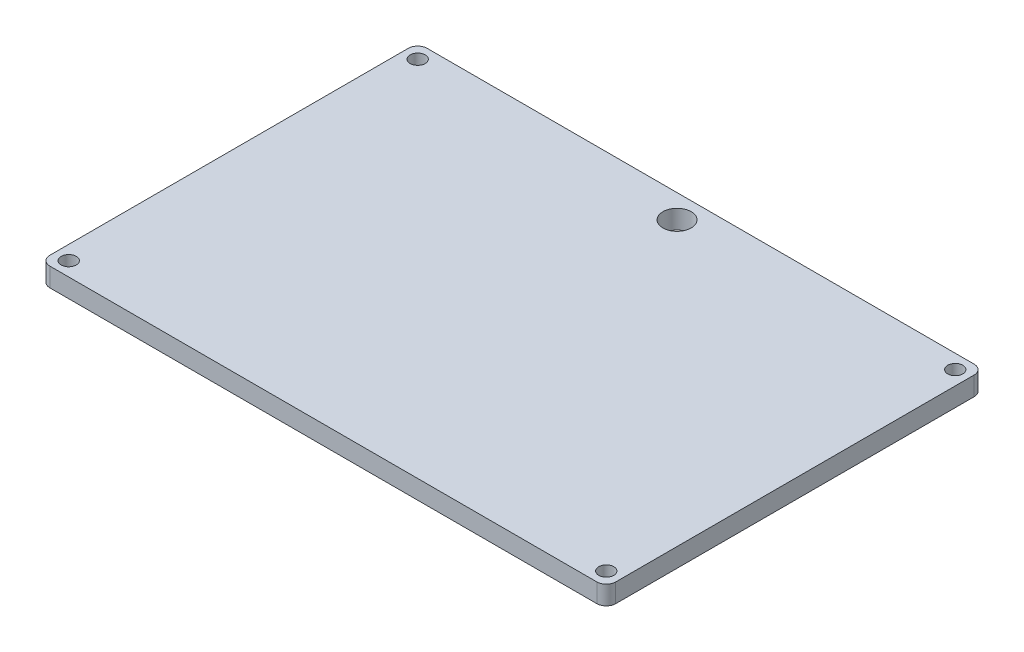
ISO-10303-21;
HEADER;
FILE_DESCRIPTION(('STEP AP214'),'2;1');
FILE_NAME('part.step','',(''),(''),'','','');
FILE_SCHEMA(('AUTOMOTIVE_DESIGN { 1 0 10303 214 1 1 1 1 }'));
ENDSEC;
DATA;
#1=APPLICATION_CONTEXT('core data for automotive mechanical design processes');
#2=APPLICATION_PROTOCOL_DEFINITION('international standard','automotive_design',2000,#1);
#3=PRODUCT_CONTEXT('',#1,'mechanical');
#4=PRODUCT('Part','Part','',(#3));
#5=PRODUCT_RELATED_PRODUCT_CATEGORY('part','',(#4));
#6=PRODUCT_DEFINITION_FORMATION('','',#4);
#7=PRODUCT_DEFINITION_CONTEXT('part definition',#1,'design');
#8=PRODUCT_DEFINITION('design','',#6,#7);
#9=PRODUCT_DEFINITION_SHAPE('','',#8);
#10=(LENGTH_UNIT() NAMED_UNIT(*) SI_UNIT(.MILLI.,.METRE.));
#11=(NAMED_UNIT(*) PLANE_ANGLE_UNIT() SI_UNIT($,.RADIAN.));
#12=(NAMED_UNIT(*) SI_UNIT($,.STERADIAN.) SOLID_ANGLE_UNIT());
#13=UNCERTAINTY_MEASURE_WITH_UNIT(LENGTH_MEASURE(1.E-05),#10,'distance_accuracy_value','');
#14=(GEOMETRIC_REPRESENTATION_CONTEXT(3) GLOBAL_UNCERTAINTY_ASSIGNED_CONTEXT((#13)) GLOBAL_UNIT_ASSIGNED_CONTEXT((#10,
#11,#12)) REPRESENTATION_CONTEXT('',''));
#15=CARTESIAN_POINT('',(0.,0.,0.));
#16=DIRECTION('',(0.,0.,1.));
#17=DIRECTION('',(1.,0.,0.));
#18=AXIS2_PLACEMENT_3D('',#15,#16,#17);
#19=CARTESIAN_POINT('',(0.,4.,0.));
#20=DIRECTION('',(0.,-1.,0.));
#21=DIRECTION('',(0.,0.,-1.));
#22=AXIS2_PLACEMENT_3D('',#19,#20,#21);
#23=PLANE('',#22);
#24=DIRECTION('',(-1.,0.,0.));
#25=VECTOR('',#24,1.);
#26=CARTESIAN_POINT('',(0.,4.,-80.));
#27=LINE('',#26,#25);
#28=CARTESIAN_POINT('',(118.,4.,-80.));
#29=VERTEX_POINT('',#28);
#30=CARTESIAN_POINT('',(2.,4.,-80.));
#31=VERTEX_POINT('',#30);
#32=EDGE_CURVE('E125',#29,#31,#27,.T.);
#33=ORIENTED_EDGE('',*,*,#32,.T.);
#34=CARTESIAN_POINT('',(2.,4.,-78.));
#35=DIRECTION('',(0.,-1.,0.));
#36=DIRECTION('',(0.,0.,-1.));
#37=AXIS2_PLACEMENT_3D('',#34,#35,#36);
#38=CIRCLE('',#37,2.);
#39=CARTESIAN_POINT('',(0.,4.,-78.));
#40=VERTEX_POINT('',#39);
#41=EDGE_CURVE('E11',#31,#40,#38,.F.);
#42=ORIENTED_EDGE('',*,*,#41,.T.);
#43=DIRECTION('',(0.,0.,1.));
#44=VECTOR('',#43,1.);
#45=CARTESIAN_POINT('',(0.,4.,0.));
#46=LINE('',#45,#44);
#47=CARTESIAN_POINT('',(0.,4.,-2.));
#48=VERTEX_POINT('',#47);
#49=EDGE_CURVE('E145',#40,#48,#46,.T.);
#50=ORIENTED_EDGE('',*,*,#49,.T.);
#51=CARTESIAN_POINT('',(2.,4.,-2.));
#52=DIRECTION('',(0.,-1.,0.));
#53=DIRECTION('',(0.,0.,-1.));
#54=AXIS2_PLACEMENT_3D('',#51,#52,#53);
#55=CIRCLE('',#54,2.);
#56=CARTESIAN_POINT('',(2.,4.,0.));
#57=VERTEX_POINT('',#56);
#58=EDGE_CURVE('E149',#48,#57,#55,.F.);
#59=ORIENTED_EDGE('',*,*,#58,.T.);
#60=DIRECTION('',(1.,0.,0.));
#61=VECTOR('',#60,1.);
#62=CARTESIAN_POINT('',(0.,4.,0.));
#63=LINE('',#62,#61);
#64=CARTESIAN_POINT('',(118.,4.,0.));
#65=VERTEX_POINT('',#64);
#66=EDGE_CURVE('E123',#57,#65,#63,.T.);
#67=ORIENTED_EDGE('',*,*,#66,.T.);
#68=CARTESIAN_POINT('',(118.,4.,-2.));
#69=DIRECTION('',(0.,-1.,0.));
#70=DIRECTION('',(0.,0.,-1.));
#71=AXIS2_PLACEMENT_3D('',#68,#69,#70);
#72=CIRCLE('',#71,2.);
#73=CARTESIAN_POINT('',(120.,4.,-2.));
#74=VERTEX_POINT('',#73);
#75=EDGE_CURVE('E161',#65,#74,#72,.F.);
#76=ORIENTED_EDGE('',*,*,#75,.T.);
#77=DIRECTION('',(0.,0.,-1.));
#78=VECTOR('',#77,1.);
#79=CARTESIAN_POINT('',(120.,4.,0.));
#80=LINE('',#79,#78);
#81=CARTESIAN_POINT('',(120.,4.,-78.));
#82=VERTEX_POINT('',#81);
#83=EDGE_CURVE('E185',#74,#82,#80,.T.);
#84=ORIENTED_EDGE('',*,*,#83,.T.);
#85=CARTESIAN_POINT('',(118.,4.,-78.));
#86=DIRECTION('',(0.,-1.,0.));
#87=DIRECTION('',(0.,0.,-1.));
#88=AXIS2_PLACEMENT_3D('',#85,#86,#87);
#89=CIRCLE('',#88,2.);
#90=EDGE_CURVE('E174',#82,#29,#89,.F.);
#91=ORIENTED_EDGE('',*,*,#90,.T.);
#92=EDGE_LOOP('',(#33,#42,#50,#59,#67,#76,#84,#91));
#93=FACE_BOUND('',#92,.T.);
#94=CARTESIAN_POINT('',(3.,4.,-77.));
#95=DIRECTION('',(0.,1.,0.));
#96=DIRECTION('',(0.,0.,1.));
#97=AXIS2_PLACEMENT_3D('',#94,#95,#96);
#98=CIRCLE('',#97,1.6);
#99=CARTESIAN_POINT('',(3.,4.,-75.4));
#100=VERTEX_POINT('',#99);
#101=EDGE_CURVE('E140',#100,#100,#98,.T.);
#102=ORIENTED_EDGE('',*,*,#101,.F.);
#103=EDGE_LOOP('',(#102));
#104=FACE_BOUND('',#103,.T.);
#105=CARTESIAN_POINT('',(3.,4.,-3.));
#106=DIRECTION('',(0.,1.,0.));
#107=DIRECTION('',(0.,0.,1.));
#108=AXIS2_PLACEMENT_3D('',#105,#106,#107);
#109=CIRCLE('',#108,1.6);
#110=CARTESIAN_POINT('',(3.,4.,-1.4));
#111=VERTEX_POINT('',#110);
#112=EDGE_CURVE('E199',#111,#111,#109,.T.);
#113=ORIENTED_EDGE('',*,*,#112,.F.);
#114=EDGE_LOOP('',(#113));
#115=FACE_BOUND('',#114,.T.);
#116=CARTESIAN_POINT('',(117.,4.,-77.));
#117=DIRECTION('',(0.,1.,0.));
#118=DIRECTION('',(0.,0.,1.));
#119=AXIS2_PLACEMENT_3D('',#116,#117,#118);
#120=CIRCLE('',#119,1.60000000000001);
#121=CARTESIAN_POINT('',(117.,4.,-75.4));
#122=VERTEX_POINT('',#121);
#123=EDGE_CURVE('E207',#122,#122,#120,.T.);
#124=ORIENTED_EDGE('',*,*,#123,.F.);
#125=EDGE_LOOP('',(#124));
#126=FACE_BOUND('',#125,.T.);
#127=CARTESIAN_POINT('',(117.,4.,-3.));
#128=DIRECTION('',(0.,1.,0.));
#129=DIRECTION('',(0.,0.,1.));
#130=AXIS2_PLACEMENT_3D('',#127,#128,#129);
#131=CIRCLE('',#130,1.60000000000001);
#132=CARTESIAN_POINT('',(117.,4.,-1.4));
#133=VERTEX_POINT('',#132);
#134=EDGE_CURVE('E215',#133,#133,#131,.T.);
#135=ORIENTED_EDGE('',*,*,#134,.F.);
#136=EDGE_LOOP('',(#135));
#137=FACE_BOUND('',#136,.T.);
#138=CARTESIAN_POINT('',(60.,4.,-75.));
#139=DIRECTION('',(0.,1.,0.));
#140=DIRECTION('',(0.,0.,1.));
#141=AXIS2_PLACEMENT_3D('',#138,#139,#140);
#142=CIRCLE('',#141,3.00000000000001);
#143=CARTESIAN_POINT('',(60.,4.,-72.));
#144=VERTEX_POINT('',#143);
#145=EDGE_CURVE('E223',#144,#144,#142,.T.);
#146=ORIENTED_EDGE('',*,*,#145,.F.);
#147=EDGE_LOOP('',(#146));
#148=FACE_BOUND('',#147,.T.);
#149=ADVANCED_FACE('F39',(#93,#104,#115,#126,#137,#148),#23,.F.);
#150=CARTESIAN_POINT('',(0.,0.,0.));
#151=DIRECTION('',(0.,-1.,0.));
#152=DIRECTION('',(0.,0.,-1.));
#153=AXIS2_PLACEMENT_3D('',#150,#151,#152);
#154=PLANE('',#153);
#155=CARTESIAN_POINT('',(117.,0.,-3.));
#156=DIRECTION('',(0.,1.,0.));
#157=DIRECTION('',(0.,0.,1.));
#158=AXIS2_PLACEMENT_3D('',#155,#156,#157);
#159=CIRCLE('',#158,1.60000000000001);
#160=CARTESIAN_POINT('',(117.,0.,-1.4));
#161=VERTEX_POINT('',#160);
#162=EDGE_CURVE('E219',#161,#161,#159,.T.);
#163=ORIENTED_EDGE('',*,*,#162,.T.);
#164=EDGE_LOOP('',(#163));
#165=FACE_BOUND('',#164,.T.);
#166=CARTESIAN_POINT('',(3.,0.,-3.));
#167=DIRECTION('',(0.,1.,0.));
#168=DIRECTION('',(0.,0.,1.));
#169=AXIS2_PLACEMENT_3D('',#166,#167,#168);
#170=CIRCLE('',#169,1.6);
#171=CARTESIAN_POINT('',(3.,0.,-1.4));
#172=VERTEX_POINT('',#171);
#173=EDGE_CURVE('E203',#172,#172,#170,.T.);
#174=ORIENTED_EDGE('',*,*,#173,.T.);
#175=EDGE_LOOP('',(#174));
#176=FACE_BOUND('',#175,.T.);
#177=DIRECTION('',(0.,0.,1.));
#178=VECTOR('',#177,1.);
#179=CARTESIAN_POINT('',(0.,0.,0.));
#180=LINE('',#179,#178);
#181=CARTESIAN_POINT('',(0.,0.,-78.));
#182=VERTEX_POINT('',#181);
#183=CARTESIAN_POINT('',(0.,0.,-2.));
#184=VERTEX_POINT('',#183);
#185=EDGE_CURVE('E133',#182,#184,#180,.T.);
#186=ORIENTED_EDGE('',*,*,#185,.F.);
#187=CARTESIAN_POINT('',(2.,0.,-78.));
#188=DIRECTION('',(0.,-1.,0.));
#189=DIRECTION('',(0.,0.,-1.));
#190=AXIS2_PLACEMENT_3D('',#187,#188,#189);
#191=CIRCLE('',#190,2.);
#192=CARTESIAN_POINT('',(2.,0.,-80.));
#193=VERTEX_POINT('',#192);
#194=EDGE_CURVE('E62',#182,#193,#191,.T.);
#195=ORIENTED_EDGE('',*,*,#194,.T.);
#196=DIRECTION('',(-1.,0.,0.));
#197=VECTOR('',#196,1.);
#198=CARTESIAN_POINT('',(0.,0.,-80.));
#199=LINE('',#198,#197);
#200=CARTESIAN_POINT('',(118.,0.,-80.));
#201=VERTEX_POINT('',#200);
#202=EDGE_CURVE('E138',#201,#193,#199,.T.);
#203=ORIENTED_EDGE('',*,*,#202,.F.);
#204=CARTESIAN_POINT('',(118.,0.,-78.));
#205=DIRECTION('',(0.,-1.,0.));
#206=DIRECTION('',(0.,0.,-1.));
#207=AXIS2_PLACEMENT_3D('',#204,#205,#206);
#208=CIRCLE('',#207,2.);
#209=CARTESIAN_POINT('',(120.,0.,-78.));
#210=VERTEX_POINT('',#209);
#211=EDGE_CURVE('E168',#201,#210,#208,.T.);
#212=ORIENTED_EDGE('',*,*,#211,.T.);
#213=DIRECTION('',(0.,0.,-1.));
#214=VECTOR('',#213,1.);
#215=CARTESIAN_POINT('',(120.,0.,0.));
#216=LINE('',#215,#214);
#217=CARTESIAN_POINT('',(120.,0.,-2.));
#218=VERTEX_POINT('',#217);
#219=EDGE_CURVE('E132',#218,#210,#216,.T.);
#220=ORIENTED_EDGE('',*,*,#219,.F.);
#221=CARTESIAN_POINT('',(118.,0.,-2.));
#222=DIRECTION('',(0.,-1.,0.));
#223=DIRECTION('',(0.,0.,-1.));
#224=AXIS2_PLACEMENT_3D('',#221,#222,#223);
#225=CIRCLE('',#224,2.);
#226=CARTESIAN_POINT('',(118.,0.,0.));
#227=VERTEX_POINT('',#226);
#228=EDGE_CURVE('E130',#218,#227,#225,.T.);
#229=ORIENTED_EDGE('',*,*,#228,.T.);
#230=DIRECTION('',(1.,0.,0.));
#231=VECTOR('',#230,1.);
#232=CARTESIAN_POINT('',(0.,0.,0.));
#233=LINE('',#232,#231);
#234=CARTESIAN_POINT('',(2.,0.,0.));
#235=VERTEX_POINT('',#234);
#236=EDGE_CURVE('E120',#235,#227,#233,.T.);
#237=ORIENTED_EDGE('',*,*,#236,.F.);
#238=CARTESIAN_POINT('',(2.,0.,-2.));
#239=DIRECTION('',(0.,-1.,0.));
#240=DIRECTION('',(0.,0.,-1.));
#241=AXIS2_PLACEMENT_3D('',#238,#239,#240);
#242=CIRCLE('',#241,2.);
#243=EDGE_CURVE('E106',#235,#184,#242,.T.);
#244=ORIENTED_EDGE('',*,*,#243,.T.);
#245=EDGE_LOOP('',(#186,#195,#203,#212,#220,#229,#237,#244));
#246=FACE_BOUND('',#245,.T.);
#247=CARTESIAN_POINT('',(3.,0.,-77.));
#248=DIRECTION('',(0.,1.,0.));
#249=DIRECTION('',(0.,0.,1.));
#250=AXIS2_PLACEMENT_3D('',#247,#248,#249);
#251=CIRCLE('',#250,1.6);
#252=CARTESIAN_POINT('',(3.,0.,-75.4));
#253=VERTEX_POINT('',#252);
#254=EDGE_CURVE('E195',#253,#253,#251,.T.);
#255=ORIENTED_EDGE('',*,*,#254,.T.);
#256=EDGE_LOOP('',(#255));
#257=FACE_BOUND('',#256,.T.);
#258=CARTESIAN_POINT('',(117.,0.,-77.));
#259=DIRECTION('',(0.,1.,0.));
#260=DIRECTION('',(0.,0.,1.));
#261=AXIS2_PLACEMENT_3D('',#258,#259,#260);
#262=CIRCLE('',#261,1.60000000000001);
#263=CARTESIAN_POINT('',(117.,0.,-75.4));
#264=VERTEX_POINT('',#263);
#265=EDGE_CURVE('E211',#264,#264,#262,.T.);
#266=ORIENTED_EDGE('',*,*,#265,.T.);
#267=EDGE_LOOP('',(#266));
#268=FACE_BOUND('',#267,.T.);
#269=CARTESIAN_POINT('',(60.,0.,-75.));
#270=DIRECTION('',(0.,1.,0.));
#271=DIRECTION('',(0.,0.,1.));
#272=AXIS2_PLACEMENT_3D('',#269,#270,#271);
#273=CIRCLE('',#272,3.00000000000001);
#274=CARTESIAN_POINT('',(60.,0.,-72.));
#275=VERTEX_POINT('',#274);
#276=EDGE_CURVE('E227',#275,#275,#273,.T.);
#277=ORIENTED_EDGE('',*,*,#276,.T.);
#278=EDGE_LOOP('',(#277));
#279=FACE_BOUND('',#278,.T.);
#280=ADVANCED_FACE('F127',(#165,#176,#246,#257,#268,#279),#154,.T.);
#281=CARTESIAN_POINT('',(0.,4.,0.));
#282=DIRECTION('',(1.,0.,0.));
#283=DIRECTION('',(0.,0.,-1.));
#284=AXIS2_PLACEMENT_3D('',#281,#282,#283);
#285=PLANE('',#284);
#286=ORIENTED_EDGE('',*,*,#49,.F.);
#287=DIRECTION('',(0.,-1.,0.));
#288=VECTOR('',#287,1.);
#289=CARTESIAN_POINT('',(0.,4.,-78.));
#290=LINE('',#289,#288);
#291=EDGE_CURVE('E177',#40,#182,#290,.T.);
#292=ORIENTED_EDGE('',*,*,#291,.T.);
#293=ORIENTED_EDGE('',*,*,#185,.T.);
#294=DIRECTION('',(0.,-1.,0.));
#295=VECTOR('',#294,1.);
#296=CARTESIAN_POINT('',(0.,4.,-2.));
#297=LINE('',#296,#295);
#298=EDGE_CURVE('E112',#184,#48,#297,.F.);
#299=ORIENTED_EDGE('',*,*,#298,.T.);
#300=EDGE_LOOP('',(#286,#292,#293,#299));
#301=FACE_BOUND('',#300,.T.);
#302=ADVANCED_FACE('F243',(#301),#285,.F.);
#303=CARTESIAN_POINT('',(0.,4.,0.));
#304=DIRECTION('',(0.,0.,-1.));
#305=DIRECTION('',(-1.,0.,0.));
#306=AXIS2_PLACEMENT_3D('',#303,#304,#305);
#307=PLANE('',#306);
#308=ORIENTED_EDGE('',*,*,#236,.T.);
#309=DIRECTION('',(0.,-1.,0.));
#310=VECTOR('',#309,1.);
#311=CARTESIAN_POINT('',(118.,4.,0.));
#312=LINE('',#311,#310);
#313=EDGE_CURVE('E158',#227,#65,#312,.F.);
#314=ORIENTED_EDGE('',*,*,#313,.T.);
#315=ORIENTED_EDGE('',*,*,#66,.F.);
#316=DIRECTION('',(0.,-1.,0.));
#317=VECTOR('',#316,1.);
#318=CARTESIAN_POINT('',(2.,4.,0.));
#319=LINE('',#318,#317);
#320=EDGE_CURVE('E110',#57,#235,#319,.T.);
#321=ORIENTED_EDGE('',*,*,#320,.T.);
#322=EDGE_LOOP('',(#308,#314,#315,#321));
#323=FACE_BOUND('',#322,.T.);
#324=ADVANCED_FACE('F119',(#323),#307,.F.);
#325=CARTESIAN_POINT('',(120.,4.,0.));
#326=DIRECTION('',(-1.,0.,0.));
#327=DIRECTION('',(0.,0.,1.));
#328=AXIS2_PLACEMENT_3D('',#325,#326,#327);
#329=PLANE('',#328);
#330=ORIENTED_EDGE('',*,*,#219,.T.);
#331=DIRECTION('',(0.,-1.,0.));
#332=VECTOR('',#331,1.);
#333=CARTESIAN_POINT('',(120.,4.,-78.));
#334=LINE('',#333,#332);
#335=EDGE_CURVE('E171',#210,#82,#334,.F.);
#336=ORIENTED_EDGE('',*,*,#335,.T.);
#337=ORIENTED_EDGE('',*,*,#83,.F.);
#338=DIRECTION('',(0.,-1.,0.));
#339=VECTOR('',#338,1.);
#340=CARTESIAN_POINT('',(120.,4.,-2.));
#341=LINE('',#340,#339);
#342=EDGE_CURVE('E152',#74,#218,#341,.T.);
#343=ORIENTED_EDGE('',*,*,#342,.T.);
#344=EDGE_LOOP('',(#330,#336,#337,#343));
#345=FACE_BOUND('',#344,.T.);
#346=ADVANCED_FACE('F254',(#345),#329,.F.);
#347=CARTESIAN_POINT('',(0.,4.,-80.));
#348=DIRECTION('',(0.,0.,1.));
#349=DIRECTION('',(1.,0.,0.));
#350=AXIS2_PLACEMENT_3D('',#347,#348,#349);
#351=PLANE('',#350);
#352=ORIENTED_EDGE('',*,*,#202,.T.);
#353=DIRECTION('',(0.,-1.,0.));
#354=VECTOR('',#353,1.);
#355=CARTESIAN_POINT('',(2.,4.,-80.));
#356=LINE('',#355,#354);
#357=EDGE_CURVE('E48',#193,#31,#356,.F.);
#358=ORIENTED_EDGE('',*,*,#357,.T.);
#359=ORIENTED_EDGE('',*,*,#32,.F.);
#360=DIRECTION('',(0.,-1.,0.));
#361=VECTOR('',#360,1.);
#362=CARTESIAN_POINT('',(118.,4.,-80.));
#363=LINE('',#362,#361);
#364=EDGE_CURVE('E164',#29,#201,#363,.T.);
#365=ORIENTED_EDGE('',*,*,#364,.T.);
#366=EDGE_LOOP('',(#352,#358,#359,#365));
#367=FACE_BOUND('',#366,.T.);
#368=ADVANCED_FACE('F251',(#367),#351,.F.);
#369=CARTESIAN_POINT('',(3.,4.,-77.));
#370=DIRECTION('',(0.,-1.,0.));
#371=DIRECTION('',(0.,0.,-1.));
#372=AXIS2_PLACEMENT_3D('',#369,#370,#371);
#373=CYLINDRICAL_SURFACE('',#372,1.6);
#374=ORIENTED_EDGE('',*,*,#101,.T.);
#375=EDGE_LOOP('',(#374));
#376=FACE_BOUND('',#375,.T.);
#377=ORIENTED_EDGE('',*,*,#254,.F.);
#378=EDGE_LOOP('',(#377));
#379=FACE_BOUND('',#378,.T.);
#380=ADVANCED_FACE('F248',(#376,#379),#373,.F.);
#381=CARTESIAN_POINT('',(3.,4.,-3.));
#382=DIRECTION('',(0.,-1.,0.));
#383=DIRECTION('',(0.,0.,-1.));
#384=AXIS2_PLACEMENT_3D('',#381,#382,#383);
#385=CYLINDRICAL_SURFACE('',#384,1.6);
#386=ORIENTED_EDGE('',*,*,#112,.T.);
#387=EDGE_LOOP('',(#386));
#388=FACE_BOUND('',#387,.T.);
#389=ORIENTED_EDGE('',*,*,#173,.F.);
#390=EDGE_LOOP('',(#389));
#391=FACE_BOUND('',#390,.T.);
#392=ADVANCED_FACE('F365',(#388,#391),#385,.F.);
#393=CARTESIAN_POINT('',(117.,4.,-77.));
#394=DIRECTION('',(0.,-1.,0.));
#395=DIRECTION('',(0.,0.,-1.));
#396=AXIS2_PLACEMENT_3D('',#393,#394,#395);
#397=CYLINDRICAL_SURFACE('',#396,1.60000000000001);
#398=ORIENTED_EDGE('',*,*,#123,.T.);
#399=EDGE_LOOP('',(#398));
#400=FACE_BOUND('',#399,.T.);
#401=ORIENTED_EDGE('',*,*,#265,.F.);
#402=EDGE_LOOP('',(#401));
#403=FACE_BOUND('',#402,.T.);
#404=ADVANCED_FACE('F355',(#400,#403),#397,.F.);
#405=CARTESIAN_POINT('',(117.,4.,-3.));
#406=DIRECTION('',(0.,-1.,0.));
#407=DIRECTION('',(0.,0.,-1.));
#408=AXIS2_PLACEMENT_3D('',#405,#406,#407);
#409=CYLINDRICAL_SURFACE('',#408,1.60000000000001);
#410=ORIENTED_EDGE('',*,*,#134,.T.);
#411=EDGE_LOOP('',(#410));
#412=FACE_BOUND('',#411,.T.);
#413=ORIENTED_EDGE('',*,*,#162,.F.);
#414=EDGE_LOOP('',(#413));
#415=FACE_BOUND('',#414,.T.);
#416=ADVANCED_FACE('F346',(#412,#415),#409,.F.);
#417=CARTESIAN_POINT('',(60.,4.,-75.));
#418=DIRECTION('',(0.,-1.,0.));
#419=DIRECTION('',(0.,0.,-1.));
#420=AXIS2_PLACEMENT_3D('',#417,#418,#419);
#421=CYLINDRICAL_SURFACE('',#420,3.00000000000001);
#422=ORIENTED_EDGE('',*,*,#145,.T.);
#423=EDGE_LOOP('',(#422));
#424=FACE_BOUND('',#423,.T.);
#425=ORIENTED_EDGE('',*,*,#276,.F.);
#426=EDGE_LOOP('',(#425));
#427=FACE_BOUND('',#426,.T.);
#428=ADVANCED_FACE('F235',(#424,#427),#421,.F.);
#429=CARTESIAN_POINT('',(2.,4.,-2.));
#430=DIRECTION('',(0.,-1.,0.));
#431=DIRECTION('',(0.,0.,-1.));
#432=AXIS2_PLACEMENT_3D('',#429,#430,#431);
#433=CYLINDRICAL_SURFACE('',#432,2.);
#434=ORIENTED_EDGE('',*,*,#58,.F.);
#435=ORIENTED_EDGE('',*,*,#298,.F.);
#436=ORIENTED_EDGE('',*,*,#243,.F.);
#437=ORIENTED_EDGE('',*,*,#320,.F.);
#438=EDGE_LOOP('',(#434,#435,#436,#437));
#439=FACE_BOUND('',#438,.T.);
#440=ADVANCED_FACE('F109',(#439),#433,.T.);
#441=CARTESIAN_POINT('',(118.,4.,-2.));
#442=DIRECTION('',(0.,-1.,0.));
#443=DIRECTION('',(0.,0.,-1.));
#444=AXIS2_PLACEMENT_3D('',#441,#442,#443);
#445=CYLINDRICAL_SURFACE('',#444,2.);
#446=ORIENTED_EDGE('',*,*,#75,.F.);
#447=ORIENTED_EDGE('',*,*,#313,.F.);
#448=ORIENTED_EDGE('',*,*,#228,.F.);
#449=ORIENTED_EDGE('',*,*,#342,.F.);
#450=EDGE_LOOP('',(#446,#447,#448,#449));
#451=FACE_BOUND('',#450,.T.);
#452=ADVANCED_FACE('F265',(#451),#445,.T.);
#453=CARTESIAN_POINT('',(118.,4.,-78.));
#454=DIRECTION('',(0.,-1.,0.));
#455=DIRECTION('',(0.,0.,-1.));
#456=AXIS2_PLACEMENT_3D('',#453,#454,#455);
#457=CYLINDRICAL_SURFACE('',#456,2.);
#458=ORIENTED_EDGE('',*,*,#90,.F.);
#459=ORIENTED_EDGE('',*,*,#335,.F.);
#460=ORIENTED_EDGE('',*,*,#211,.F.);
#461=ORIENTED_EDGE('',*,*,#364,.F.);
#462=EDGE_LOOP('',(#458,#459,#460,#461));
#463=FACE_BOUND('',#462,.T.);
#464=ADVANCED_FACE('F267',(#463),#457,.T.);
#465=CARTESIAN_POINT('',(2.,4.,-78.));
#466=DIRECTION('',(0.,-1.,0.));
#467=DIRECTION('',(0.,0.,-1.));
#468=AXIS2_PLACEMENT_3D('',#465,#466,#467);
#469=CYLINDRICAL_SURFACE('',#468,2.);
#470=ORIENTED_EDGE('',*,*,#41,.F.);
#471=ORIENTED_EDGE('',*,*,#357,.F.);
#472=ORIENTED_EDGE('',*,*,#194,.F.);
#473=ORIENTED_EDGE('',*,*,#291,.F.);
#474=EDGE_LOOP('',(#470,#471,#472,#473));
#475=FACE_BOUND('',#474,.T.);
#476=ADVANCED_FACE('F41',(#475),#469,.T.);
#477=CLOSED_SHELL('',(#149,#280,#302,#324,#346,#368,#380,#392,#404,#416,#428,#440,#452,#464,#476));
#478=MANIFOLD_SOLID_BREP('B2',#477);
#479=ADVANCED_BREP_SHAPE_REPRESENTATION('',(#18,#478),#14);
#480=SHAPE_DEFINITION_REPRESENTATION(#9,#479);
ENDSEC;
END-ISO-10303-21;
